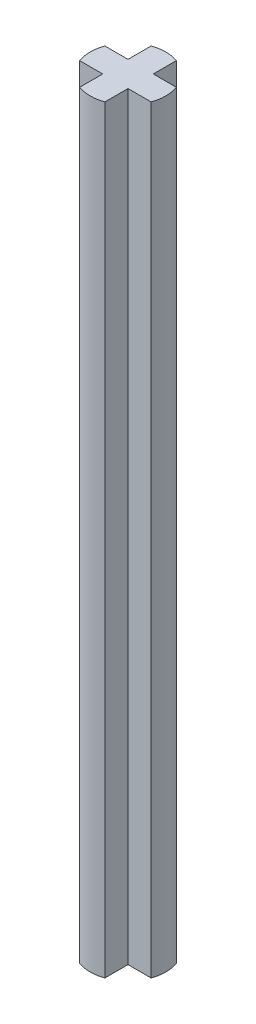
ISO-10303-21;
HEADER;
FILE_DESCRIPTION(('STEP AP214'),'2;1');
FILE_NAME('part.step','',(''),(''),'','','');
FILE_SCHEMA(('AUTOMOTIVE_DESIGN { 1 0 10303 214 1 1 1 1 }'));
ENDSEC;
DATA;
#1=APPLICATION_CONTEXT('core data for automotive mechanical design processes');
#2=APPLICATION_PROTOCOL_DEFINITION('international standard','automotive_design',2000,#1);
#3=PRODUCT_CONTEXT('',#1,'mechanical');
#4=PRODUCT('Part','Part','',(#3));
#5=PRODUCT_RELATED_PRODUCT_CATEGORY('part','',(#4));
#6=PRODUCT_DEFINITION_FORMATION('','',#4);
#7=PRODUCT_DEFINITION_CONTEXT('part definition',#1,'design');
#8=PRODUCT_DEFINITION('design','',#6,#7);
#9=PRODUCT_DEFINITION_SHAPE('','',#8);
#10=(LENGTH_UNIT() NAMED_UNIT(*) SI_UNIT(.MILLI.,.METRE.));
#11=(NAMED_UNIT(*) PLANE_ANGLE_UNIT() SI_UNIT($,.RADIAN.));
#12=(NAMED_UNIT(*) SI_UNIT($,.STERADIAN.) SOLID_ANGLE_UNIT());
#13=UNCERTAINTY_MEASURE_WITH_UNIT(LENGTH_MEASURE(1.E-05),#10,'distance_accuracy_value','');
#14=(GEOMETRIC_REPRESENTATION_CONTEXT(3) GLOBAL_UNCERTAINTY_ASSIGNED_CONTEXT((#13)) GLOBAL_UNIT_ASSIGNED_CONTEXT((#10,
#11,#12)) REPRESENTATION_CONTEXT('',''));
#15=CARTESIAN_POINT('',(0.,0.,0.));
#16=DIRECTION('',(0.,0.,1.));
#17=DIRECTION('',(1.,0.,0.));
#18=AXIS2_PLACEMENT_3D('',#15,#16,#17);
#19=CARTESIAN_POINT('',(-1.5,30.,0.5));
#20=DIRECTION('',(0.,0.,-1.));
#21=DIRECTION('',(-1.,0.,0.));
#22=AXIS2_PLACEMENT_3D('',#19,#20,#21);
#23=PLANE('',#22);
#24=DIRECTION('',(0.,1.,0.));
#25=VECTOR('',#24,1.);
#26=CARTESIAN_POINT('',(-1.4142135623731,-0.001000000000001,0.5));
#27=LINE('',#26,#25);
#28=CARTESIAN_POINT('',(-1.4142135623731,30.,0.5));
#29=VERTEX_POINT('',#28);
#30=CARTESIAN_POINT('',(-1.4142135623731,0.,0.5));
#31=VERTEX_POINT('',#30);
#32=EDGE_CURVE('E243',#29,#31,#27,.F.);
#33=ORIENTED_EDGE('',*,*,#32,.T.);
#34=DIRECTION('',(1.,0.,0.));
#35=VECTOR('',#34,1.);
#36=CARTESIAN_POINT('',(-1.5,0.,0.5));
#37=LINE('',#36,#35);
#38=CARTESIAN_POINT('',(-0.5,0.,0.5));
#39=VERTEX_POINT('',#38);
#40=EDGE_CURVE('E211',#31,#39,#37,.T.);
#41=ORIENTED_EDGE('',*,*,#40,.T.);
#42=DIRECTION('',(0.,1.,0.));
#43=VECTOR('',#42,1.);
#44=CARTESIAN_POINT('',(-0.5,30.,0.5));
#45=LINE('',#44,#43);
#46=CARTESIAN_POINT('',(-0.5,30.,0.5));
#47=VERTEX_POINT('',#46);
#48=EDGE_CURVE('E65',#39,#47,#45,.T.);
#49=ORIENTED_EDGE('',*,*,#48,.T.);
#50=DIRECTION('',(1.,0.,0.));
#51=VECTOR('',#50,1.);
#52=CARTESIAN_POINT('',(-1.5,30.,0.5));
#53=LINE('',#52,#51);
#54=EDGE_CURVE('E206',#29,#47,#53,.T.);
#55=ORIENTED_EDGE('',*,*,#54,.F.);
#56=EDGE_LOOP('',(#33,#41,#49,#55));
#57=FACE_BOUND('',#56,.T.);
#58=ADVANCED_FACE('F57',(#57),#23,.F.);
#59=CARTESIAN_POINT('',(-1.5,30.,-0.5));
#60=DIRECTION('',(0.,0.,-1.));
#61=DIRECTION('',(-1.,0.,0.));
#62=AXIS2_PLACEMENT_3D('',#59,#60,#61);
#63=PLANE('',#62);
#64=DIRECTION('',(1.,0.,0.));
#65=VECTOR('',#64,1.);
#66=CARTESIAN_POINT('',(-1.5,0.,-0.5));
#67=LINE('',#66,#65);
#68=CARTESIAN_POINT('',(-1.4142135623731,0.,-0.5));
#69=VERTEX_POINT('',#68);
#70=CARTESIAN_POINT('',(-0.5,0.,-0.5));
#71=VERTEX_POINT('',#70);
#72=EDGE_CURVE('E214',#69,#71,#67,.T.);
#73=ORIENTED_EDGE('',*,*,#72,.F.);
#74=DIRECTION('',(0.,1.,0.));
#75=VECTOR('',#74,1.);
#76=CARTESIAN_POINT('',(-1.4142135623731,-0.001000000000001,-0.5));
#77=LINE('',#76,#75);
#78=CARTESIAN_POINT('',(-1.4142135623731,30.,-0.5));
#79=VERTEX_POINT('',#78);
#80=EDGE_CURVE('E240',#79,#69,#77,.F.);
#81=ORIENTED_EDGE('',*,*,#80,.F.);
#82=DIRECTION('',(1.,0.,0.));
#83=VECTOR('',#82,1.);
#84=CARTESIAN_POINT('',(-1.5,30.,-0.5));
#85=LINE('',#84,#83);
#86=CARTESIAN_POINT('',(-0.5,30.,-0.5));
#87=VERTEX_POINT('',#86);
#88=EDGE_CURVE('E187',#79,#87,#85,.T.);
#89=ORIENTED_EDGE('',*,*,#88,.T.);
#90=DIRECTION('',(0.,1.,0.));
#91=VECTOR('',#90,1.);
#92=CARTESIAN_POINT('',(-0.5,30.,-0.5));
#93=LINE('',#92,#91);
#94=EDGE_CURVE('E183',#71,#87,#93,.T.);
#95=ORIENTED_EDGE('',*,*,#94,.F.);
#96=EDGE_LOOP('',(#73,#81,#89,#95));
#97=FACE_BOUND('',#96,.T.);
#98=ADVANCED_FACE('F259',(#97),#63,.T.);
#99=CARTESIAN_POINT('',(0.,0.,0.));
#100=DIRECTION('',(0.,1.,0.));
#101=DIRECTION('',(0.,0.,1.));
#102=AXIS2_PLACEMENT_3D('',#99,#100,#101);
#103=PLANE('',#102);
#104=CARTESIAN_POINT('',(0.,0.,0.));
#105=DIRECTION('',(0.,1.,0.));
#106=DIRECTION('',(0.,0.,1.));
#107=AXIS2_PLACEMENT_3D('',#104,#105,#106);
#108=CIRCLE('',#107,1.5);
#109=EDGE_CURVE('E162',#31,#69,#108,.F.);
#110=ORIENTED_EDGE('',*,*,#109,.T.);
#111=ORIENTED_EDGE('',*,*,#72,.T.);
#112=DIRECTION('',(0.,0.,-1.));
#113=VECTOR('',#112,1.);
#114=CARTESIAN_POINT('',(-0.5,0.,1.5));
#115=LINE('',#114,#113);
#116=CARTESIAN_POINT('',(-0.5,0.,-1.4142135623731));
#117=VERTEX_POINT('',#116);
#118=EDGE_CURVE('E174',#71,#117,#115,.T.);
#119=ORIENTED_EDGE('',*,*,#118,.T.);
#120=CARTESIAN_POINT('',(0.5,0.,-1.4142135623731));
#121=VERTEX_POINT('',#120);
#122=EDGE_CURVE('E159',#117,#121,#108,.F.);
#123=ORIENTED_EDGE('',*,*,#122,.T.);
#124=DIRECTION('',(0.,0.,-1.));
#125=VECTOR('',#124,1.);
#126=CARTESIAN_POINT('',(0.5,0.,1.5));
#127=LINE('',#126,#125);
#128=CARTESIAN_POINT('',(0.5,0.,-0.5));
#129=VERTEX_POINT('',#128);
#130=EDGE_CURVE('E253',#129,#121,#127,.T.);
#131=ORIENTED_EDGE('',*,*,#130,.F.);
#132=CARTESIAN_POINT('',(1.41421356237309,0.,-0.5));
#133=VERTEX_POINT('',#132);
#134=EDGE_CURVE('E196',#129,#133,#67,.T.);
#135=ORIENTED_EDGE('',*,*,#134,.T.);
#136=CARTESIAN_POINT('',(1.41421356237309,0.,0.5));
#137=VERTEX_POINT('',#136);
#138=EDGE_CURVE('E80',#133,#137,#108,.F.);
#139=ORIENTED_EDGE('',*,*,#138,.T.);
#140=CARTESIAN_POINT('',(0.5,0.,0.5));
#141=VERTEX_POINT('',#140);
#142=EDGE_CURVE('E213',#141,#137,#37,.T.);
#143=ORIENTED_EDGE('',*,*,#142,.F.);
#144=CARTESIAN_POINT('',(0.5,0.,1.4142135623731));
#145=VERTEX_POINT('',#144);
#146=EDGE_CURVE('E155',#145,#141,#127,.T.);
#147=ORIENTED_EDGE('',*,*,#146,.F.);
#148=CARTESIAN_POINT('',(-0.5,0.,1.4142135623731));
#149=VERTEX_POINT('',#148);
#150=EDGE_CURVE('E147',#145,#149,#108,.F.);
#151=ORIENTED_EDGE('',*,*,#150,.T.);
#152=EDGE_CURVE('E152',#149,#39,#115,.T.);
#153=ORIENTED_EDGE('',*,*,#152,.T.);
#154=ORIENTED_EDGE('',*,*,#40,.F.);
#155=EDGE_LOOP('',(#110,#111,#119,#123,#131,#135,#139,#143,#147,#151,#153,#154));
#156=FACE_BOUND('',#155,.T.);
#157=ADVANCED_FACE('F149',(#156),#103,.F.);
#158=CARTESIAN_POINT('',(0.,30.,0.));
#159=DIRECTION('',(0.,1.,0.));
#160=DIRECTION('',(0.,0.,1.));
#161=AXIS2_PLACEMENT_3D('',#158,#159,#160);
#162=PLANE('',#161);
#163=ORIENTED_EDGE('',*,*,#88,.F.);
#164=CARTESIAN_POINT('',(0.,30.,0.));
#165=DIRECTION('',(0.,1.,0.));
#166=DIRECTION('',(0.,0.,1.));
#167=AXIS2_PLACEMENT_3D('',#164,#165,#166);
#168=CIRCLE('',#167,1.5);
#169=EDGE_CURVE('E72',#79,#29,#168,.T.);
#170=ORIENTED_EDGE('',*,*,#169,.T.);
#171=ORIENTED_EDGE('',*,*,#54,.T.);
#172=DIRECTION('',(0.,0.,-1.));
#173=VECTOR('',#172,1.);
#174=CARTESIAN_POINT('',(-0.5,30.,1.5));
#175=LINE('',#174,#173);
#176=CARTESIAN_POINT('',(-0.5,30.,1.4142135623731));
#177=VERTEX_POINT('',#176);
#178=EDGE_CURVE('E216',#177,#47,#175,.T.);
#179=ORIENTED_EDGE('',*,*,#178,.F.);
#180=CARTESIAN_POINT('',(0.5,30.,1.4142135623731));
#181=VERTEX_POINT('',#180);
#182=EDGE_CURVE('E160',#177,#181,#168,.T.);
#183=ORIENTED_EDGE('',*,*,#182,.T.);
#184=DIRECTION('',(0.,0.,-1.));
#185=VECTOR('',#184,1.);
#186=CARTESIAN_POINT('',(0.5,30.,1.5));
#187=LINE('',#186,#185);
#188=CARTESIAN_POINT('',(0.5,30.,0.5));
#189=VERTEX_POINT('',#188);
#190=EDGE_CURVE('E177',#181,#189,#187,.T.);
#191=ORIENTED_EDGE('',*,*,#190,.T.);
#192=CARTESIAN_POINT('',(1.41421356237309,30.,0.5));
#193=VERTEX_POINT('',#192);
#194=EDGE_CURVE('E208',#189,#193,#53,.T.);
#195=ORIENTED_EDGE('',*,*,#194,.T.);
#196=CARTESIAN_POINT('',(1.41421356237309,30.,-0.5));
#197=VERTEX_POINT('',#196);
#198=EDGE_CURVE('E205',#193,#197,#168,.T.);
#199=ORIENTED_EDGE('',*,*,#198,.T.);
#200=CARTESIAN_POINT('',(0.5,30.,-0.5));
#201=VERTEX_POINT('',#200);
#202=EDGE_CURVE('E194',#201,#197,#85,.T.);
#203=ORIENTED_EDGE('',*,*,#202,.F.);
#204=CARTESIAN_POINT('',(0.5,30.,-1.4142135623731));
#205=VERTEX_POINT('',#204);
#206=EDGE_CURVE('E173',#201,#205,#187,.T.);
#207=ORIENTED_EDGE('',*,*,#206,.T.);
#208=CARTESIAN_POINT('',(-0.5,30.,-1.4142135623731));
#209=VERTEX_POINT('',#208);
#210=EDGE_CURVE('E227',#205,#209,#168,.T.);
#211=ORIENTED_EDGE('',*,*,#210,.T.);
#212=EDGE_CURVE('E215',#87,#209,#175,.T.);
#213=ORIENTED_EDGE('',*,*,#212,.F.);
#214=EDGE_LOOP('',(#163,#170,#171,#179,#183,#191,#195,#199,#203,#207,#211,#213));
#215=FACE_BOUND('',#214,.T.);
#216=ADVANCED_FACE('F203',(#215),#162,.T.);
#217=DIRECTION('',(0.,1.,0.));
#218=VECTOR('',#217,1.);
#219=CARTESIAN_POINT('',(1.4142135623731,-0.001000000000001,0.5));
#220=LINE('',#219,#218);
#221=EDGE_CURVE('E237',#137,#193,#220,.T.);
#222=ORIENTED_EDGE('',*,*,#221,.T.);
#223=ORIENTED_EDGE('',*,*,#194,.F.);
#224=DIRECTION('',(0.,1.,0.));
#225=VECTOR('',#224,1.);
#226=CARTESIAN_POINT('',(0.5,30.,0.5));
#227=LINE('',#226,#225);
#228=EDGE_CURVE('E12',#141,#189,#227,.T.);
#229=ORIENTED_EDGE('',*,*,#228,.F.);
#230=ORIENTED_EDGE('',*,*,#142,.T.);
#231=EDGE_LOOP('',(#222,#223,#229,#230));
#232=FACE_BOUND('',#231,.T.);
#233=ADVANCED_FACE('F251',(#232),#23,.F.);
#234=ORIENTED_EDGE('',*,*,#202,.T.);
#235=DIRECTION('',(0.,1.,0.));
#236=VECTOR('',#235,1.);
#237=CARTESIAN_POINT('',(1.4142135623731,-0.001000000000001,-0.5));
#238=LINE('',#237,#236);
#239=EDGE_CURVE('E232',#133,#197,#238,.T.);
#240=ORIENTED_EDGE('',*,*,#239,.F.);
#241=ORIENTED_EDGE('',*,*,#134,.F.);
#242=DIRECTION('',(0.,1.,0.));
#243=VECTOR('',#242,1.);
#244=CARTESIAN_POINT('',(0.5,30.,-0.5));
#245=LINE('',#244,#243);
#246=EDGE_CURVE('E186',#129,#201,#245,.T.);
#247=ORIENTED_EDGE('',*,*,#246,.T.);
#248=EDGE_LOOP('',(#234,#240,#241,#247));
#249=FACE_BOUND('',#248,.T.);
#250=ADVANCED_FACE('F192',(#249),#63,.T.);
#251=CARTESIAN_POINT('',(0.5,30.,1.5));
#252=DIRECTION('',(-1.,0.,0.));
#253=DIRECTION('',(0.,0.,1.));
#254=AXIS2_PLACEMENT_3D('',#251,#252,#253);
#255=PLANE('',#254);
#256=DIRECTION('',(0.,1.,0.));
#257=VECTOR('',#256,1.);
#258=CARTESIAN_POINT('',(0.5,-0.001000000000001,-1.4142135623731));
#259=LINE('',#258,#257);
#260=EDGE_CURVE('E202',#121,#205,#259,.T.);
#261=ORIENTED_EDGE('',*,*,#260,.T.);
#262=ORIENTED_EDGE('',*,*,#206,.F.);
#263=ORIENTED_EDGE('',*,*,#246,.F.);
#264=ORIENTED_EDGE('',*,*,#130,.T.);
#265=EDGE_LOOP('',(#261,#262,#263,#264));
#266=FACE_BOUND('',#265,.T.);
#267=ADVANCED_FACE('F59',(#266),#255,.F.);
#268=CARTESIAN_POINT('',(-0.5,30.,1.5));
#269=DIRECTION('',(-1.,0.,0.));
#270=DIRECTION('',(0.,0.,1.));
#271=AXIS2_PLACEMENT_3D('',#268,#269,#270);
#272=PLANE('',#271);
#273=ORIENTED_EDGE('',*,*,#212,.T.);
#274=DIRECTION('',(0.,1.,0.));
#275=VECTOR('',#274,1.);
#276=CARTESIAN_POINT('',(-0.5,-0.001000000000001,-1.4142135623731));
#277=LINE('',#276,#275);
#278=EDGE_CURVE('E225',#117,#209,#277,.T.);
#279=ORIENTED_EDGE('',*,*,#278,.F.);
#280=ORIENTED_EDGE('',*,*,#118,.F.);
#281=ORIENTED_EDGE('',*,*,#94,.T.);
#282=EDGE_LOOP('',(#273,#279,#280,#281));
#283=FACE_BOUND('',#282,.T.);
#284=ADVANCED_FACE('F222',(#283),#272,.T.);
#285=DIRECTION('',(0.,1.,0.));
#286=VECTOR('',#285,1.);
#287=CARTESIAN_POINT('',(0.5,-0.001000000000001,1.4142135623731));
#288=LINE('',#287,#286);
#289=EDGE_CURVE('E169',#181,#145,#288,.F.);
#290=ORIENTED_EDGE('',*,*,#289,.T.);
#291=ORIENTED_EDGE('',*,*,#146,.T.);
#292=ORIENTED_EDGE('',*,*,#228,.T.);
#293=ORIENTED_EDGE('',*,*,#190,.F.);
#294=EDGE_LOOP('',(#290,#291,#292,#293));
#295=FACE_BOUND('',#294,.T.);
#296=ADVANCED_FACE('F247',(#295),#255,.F.);
#297=ORIENTED_EDGE('',*,*,#152,.F.);
#298=DIRECTION('',(0.,1.,0.));
#299=VECTOR('',#298,1.);
#300=CARTESIAN_POINT('',(-0.5,-0.001000000000001,1.4142135623731));
#301=LINE('',#300,#299);
#302=EDGE_CURVE('E164',#177,#149,#301,.F.);
#303=ORIENTED_EDGE('',*,*,#302,.F.);
#304=ORIENTED_EDGE('',*,*,#178,.T.);
#305=ORIENTED_EDGE('',*,*,#48,.F.);
#306=EDGE_LOOP('',(#297,#303,#304,#305));
#307=FACE_BOUND('',#306,.T.);
#308=ADVANCED_FACE('F171',(#307),#272,.T.);
#309=CARTESIAN_POINT('',(0.,-0.001000000000001,0.));
#310=DIRECTION('',(0.,1.,0.));
#311=DIRECTION('',(0.,0.,1.));
#312=AXIS2_PLACEMENT_3D('',#309,#310,#311);
#313=CYLINDRICAL_SURFACE('',#312,1.5);
#314=ORIENTED_EDGE('',*,*,#302,.T.);
#315=ORIENTED_EDGE('',*,*,#150,.F.);
#316=ORIENTED_EDGE('',*,*,#289,.F.);
#317=ORIENTED_EDGE('',*,*,#182,.F.);
#318=EDGE_LOOP('',(#314,#315,#316,#317));
#319=FACE_BOUND('',#318,.T.);
#320=ADVANCED_FACE('F165',(#319),#313,.T.);
#321=ORIENTED_EDGE('',*,*,#260,.F.);
#322=ORIENTED_EDGE('',*,*,#122,.F.);
#323=ORIENTED_EDGE('',*,*,#278,.T.);
#324=ORIENTED_EDGE('',*,*,#210,.F.);
#325=EDGE_LOOP('',(#321,#322,#323,#324));
#326=FACE_BOUND('',#325,.T.);
#327=ADVANCED_FACE('F230',(#326),#313,.T.);
#328=ORIENTED_EDGE('',*,*,#221,.F.);
#329=ORIENTED_EDGE('',*,*,#138,.F.);
#330=ORIENTED_EDGE('',*,*,#239,.T.);
#331=ORIENTED_EDGE('',*,*,#198,.F.);
#332=EDGE_LOOP('',(#328,#329,#330,#331));
#333=FACE_BOUND('',#332,.T.);
#334=ADVANCED_FACE('F252',(#333),#313,.T.);
#335=ORIENTED_EDGE('',*,*,#80,.T.);
#336=ORIENTED_EDGE('',*,*,#109,.F.);
#337=ORIENTED_EDGE('',*,*,#32,.F.);
#338=ORIENTED_EDGE('',*,*,#169,.F.);
#339=EDGE_LOOP('',(#335,#336,#337,#338));
#340=FACE_BOUND('',#339,.T.);
#341=ADVANCED_FACE('F257',(#340),#313,.T.);
#342=CLOSED_SHELL('',(#58,#98,#157,#216,#233,#250,#267,#284,#296,#308,#320,#327,#334,#341));
#343=MANIFOLD_SOLID_BREP('B2',#342);
#344=ADVANCED_BREP_SHAPE_REPRESENTATION('',(#18,#343),#14);
#345=SHAPE_DEFINITION_REPRESENTATION(#9,#344);
ENDSEC;
END-ISO-10303-21;
